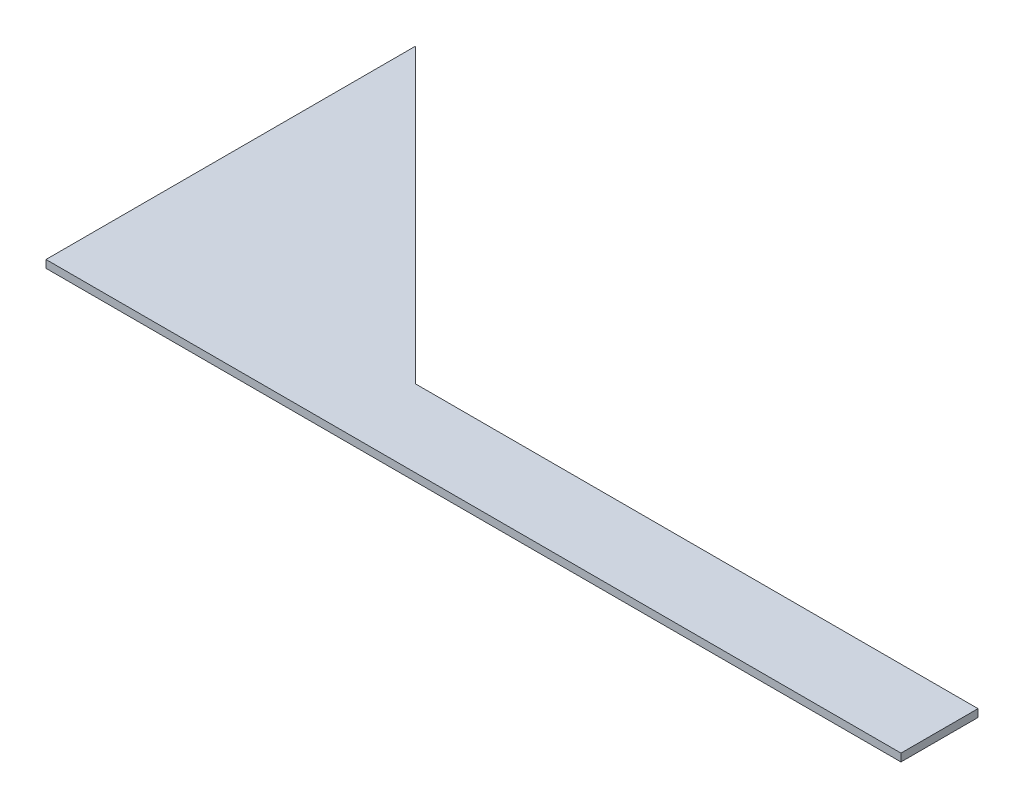
ISO-10303-21;
HEADER;
FILE_DESCRIPTION(('STEP AP214'),'2;1');
FILE_NAME('part.step','',(''),(''),'','','');
FILE_SCHEMA(('AUTOMOTIVE_DESIGN { 1 0 10303 214 1 1 1 1 }'));
ENDSEC;
DATA;
#1=APPLICATION_CONTEXT('core data for automotive mechanical design processes');
#2=APPLICATION_PROTOCOL_DEFINITION('international standard','automotive_design',2000,#1);
#3=PRODUCT_CONTEXT('',#1,'mechanical');
#4=PRODUCT('Part','Part','',(#3));
#5=PRODUCT_RELATED_PRODUCT_CATEGORY('part','',(#4));
#6=PRODUCT_DEFINITION_FORMATION('','',#4);
#7=PRODUCT_DEFINITION_CONTEXT('part definition',#1,'design');
#8=PRODUCT_DEFINITION('design','',#6,#7);
#9=PRODUCT_DEFINITION_SHAPE('','',#8);
#10=(LENGTH_UNIT() NAMED_UNIT(*) SI_UNIT(.MILLI.,.METRE.));
#11=(NAMED_UNIT(*) PLANE_ANGLE_UNIT() SI_UNIT($,.RADIAN.));
#12=(NAMED_UNIT(*) SI_UNIT($,.STERADIAN.) SOLID_ANGLE_UNIT());
#13=UNCERTAINTY_MEASURE_WITH_UNIT(LENGTH_MEASURE(1.E-05),#10,'distance_accuracy_value','');
#14=(GEOMETRIC_REPRESENTATION_CONTEXT(3) GLOBAL_UNCERTAINTY_ASSIGNED_CONTEXT((#13)) GLOBAL_UNIT_ASSIGNED_CONTEXT((#10,
#11,#12)) REPRESENTATION_CONTEXT('',''));
#15=CARTESIAN_POINT('',(0.,0.,0.));
#16=DIRECTION('',(0.,0.,1.));
#17=DIRECTION('',(1.,0.,0.));
#18=AXIS2_PLACEMENT_3D('',#15,#16,#17);
#19=CARTESIAN_POINT('',(-147.976523702142,3.175,0.));
#20=DIRECTION('',(0.,0.,1.));
#21=DIRECTION('',(1.,0.,0.));
#22=AXIS2_PLACEMENT_3D('',#19,#20,#21);
#23=PLANE('',#22);
#24=DIRECTION('',(-1.,0.,0.));
#25=VECTOR('',#24,1.);
#26=CARTESIAN_POINT('',(-147.976523702142,0.,0.));
#27=LINE('',#26,#25);
#28=CARTESIAN_POINT('',(352.425,0.,0.));
#29=VERTEX_POINT('',#28);
#30=CARTESIAN_POINT('',(0.,0.,0.));
#31=VERTEX_POINT('',#30);
#32=EDGE_CURVE('E121',#29,#31,#27,.T.);
#33=ORIENTED_EDGE('',*,*,#32,.F.);
#34=DIRECTION('',(0.,-1.,0.));
#35=VECTOR('',#34,1.);
#36=CARTESIAN_POINT('',(352.425,3.175,0.));
#37=LINE('',#36,#35);
#38=CARTESIAN_POINT('',(352.425,3.175,0.));
#39=VERTEX_POINT('',#38);
#40=EDGE_CURVE('E11',#39,#29,#37,.T.);
#41=ORIENTED_EDGE('',*,*,#40,.F.);
#42=DIRECTION('',(-1.,0.,0.));
#43=VECTOR('',#42,1.);
#44=CARTESIAN_POINT('',(-147.976523702142,3.175,0.));
#45=LINE('',#44,#43);
#46=CARTESIAN_POINT('',(0.,3.175,0.));
#47=VERTEX_POINT('',#46);
#48=EDGE_CURVE('E137',#39,#47,#45,.T.);
#49=ORIENTED_EDGE('',*,*,#48,.T.);
#50=DIRECTION('',(0.,-1.,0.));
#51=VECTOR('',#50,1.);
#52=CARTESIAN_POINT('',(0.,3.175,0.));
#53=LINE('',#52,#51);
#54=EDGE_CURVE('E57',#47,#31,#53,.T.);
#55=ORIENTED_EDGE('',*,*,#54,.T.);
#56=EDGE_LOOP('',(#33,#41,#49,#55));
#57=FACE_BOUND('',#56,.T.);
#58=ADVANCED_FACE('F41',(#57),#23,.T.);
#59=CARTESIAN_POINT('',(352.425,3.175,-51.3261523775401));
#60=DIRECTION('',(1.,0.,0.));
#61=DIRECTION('',(0.,0.,-1.));
#62=AXIS2_PLACEMENT_3D('',#59,#60,#61);
#63=PLANE('',#62);
#64=DIRECTION('',(0.,0.,1.));
#65=VECTOR('',#64,1.);
#66=CARTESIAN_POINT('',(352.425,0.,-51.3261523775401));
#67=LINE('',#66,#65);
#68=CARTESIAN_POINT('',(352.425,0.,-31.75));
#69=VERTEX_POINT('',#68);
#70=EDGE_CURVE('E124',#69,#29,#67,.T.);
#71=ORIENTED_EDGE('',*,*,#70,.F.);
#72=DIRECTION('',(0.,-1.,0.));
#73=VECTOR('',#72,1.);
#74=CARTESIAN_POINT('',(352.425,3.175,-31.75));
#75=LINE('',#74,#73);
#76=CARTESIAN_POINT('',(352.425,3.175,-31.75));
#77=VERTEX_POINT('',#76);
#78=EDGE_CURVE('E49',#77,#69,#75,.T.);
#79=ORIENTED_EDGE('',*,*,#78,.F.);
#80=DIRECTION('',(0.,0.,1.));
#81=VECTOR('',#80,1.);
#82=CARTESIAN_POINT('',(352.425,3.175,-51.3261523775401));
#83=LINE('',#82,#81);
#84=EDGE_CURVE('E110',#77,#39,#83,.T.);
#85=ORIENTED_EDGE('',*,*,#84,.T.);
#86=ORIENTED_EDGE('',*,*,#40,.T.);
#87=EDGE_LOOP('',(#71,#79,#85,#86));
#88=FACE_BOUND('',#87,.T.);
#89=ADVANCED_FACE('F143',(#88),#63,.T.);
#90=CARTESIAN_POINT('',(-147.976523702142,3.175,-31.75));
#91=DIRECTION('',(0.,0.,-1.));
#92=DIRECTION('',(-1.,0.,0.));
#93=AXIS2_PLACEMENT_3D('',#90,#91,#92);
#94=PLANE('',#93);
#95=DIRECTION('',(1.,0.,0.));
#96=VECTOR('',#95,1.);
#97=CARTESIAN_POINT('',(-147.976523702142,0.,-31.75));
#98=LINE('',#97,#96);
#99=CARTESIAN_POINT('',(120.65,0.,-31.7499999999999));
#100=VERTEX_POINT('',#99);
#101=EDGE_CURVE('E97',#100,#69,#98,.T.);
#102=ORIENTED_EDGE('',*,*,#101,.F.);
#103=DIRECTION('',(0.,-1.,0.));
#104=VECTOR('',#103,1.);
#105=CARTESIAN_POINT('',(120.65,3.175,-31.7499999999999));
#106=LINE('',#105,#104);
#107=CARTESIAN_POINT('',(120.65,3.175,-31.7499999999999));
#108=VERTEX_POINT('',#107);
#109=EDGE_CURVE('E92',#108,#100,#106,.T.);
#110=ORIENTED_EDGE('',*,*,#109,.F.);
#111=DIRECTION('',(1.,0.,0.));
#112=VECTOR('',#111,1.);
#113=CARTESIAN_POINT('',(-147.976523702142,3.175,-31.75));
#114=LINE('',#113,#112);
#115=EDGE_CURVE('E95',#108,#77,#114,.T.);
#116=ORIENTED_EDGE('',*,*,#115,.T.);
#117=ORIENTED_EDGE('',*,*,#78,.T.);
#118=EDGE_LOOP('',(#102,#110,#116,#117));
#119=FACE_BOUND('',#118,.T.);
#120=ADVANCED_FACE('F94',(#119),#94,.T.);
#121=CARTESIAN_POINT('',(-23.4513380398412,3.175,-175.851338039841));
#122=DIRECTION('',(0.707106781186548,0.,-0.707106781186548));
#123=DIRECTION('',(-0.707106781186548,0.,-0.707106781186548));
#124=AXIS2_PLACEMENT_3D('',#121,#122,#123);
#125=PLANE('',#124);
#126=DIRECTION('',(0.707106781186548,0.,0.707106781186548));
#127=VECTOR('',#126,1.);
#128=CARTESIAN_POINT('',(-23.4513380398412,0.,-175.851338039841));
#129=LINE('',#128,#127);
#130=CARTESIAN_POINT('',(0.,0.,-152.4));
#131=VERTEX_POINT('',#130);
#132=EDGE_CURVE('E130',#131,#100,#129,.T.);
#133=ORIENTED_EDGE('',*,*,#132,.F.);
#134=DIRECTION('',(0.,-1.,0.));
#135=VECTOR('',#134,1.);
#136=CARTESIAN_POINT('',(0.,3.175,-152.4));
#137=LINE('',#136,#135);
#138=CARTESIAN_POINT('',(0.,3.175,-152.4));
#139=VERTEX_POINT('',#138);
#140=EDGE_CURVE('E75',#139,#131,#137,.T.);
#141=ORIENTED_EDGE('',*,*,#140,.F.);
#142=DIRECTION('',(0.707106781186548,0.,0.707106781186548));
#143=VECTOR('',#142,1.);
#144=CARTESIAN_POINT('',(-23.4513380398412,3.175,-175.851338039841));
#145=LINE('',#144,#143);
#146=EDGE_CURVE('E108',#139,#108,#145,.T.);
#147=ORIENTED_EDGE('',*,*,#146,.T.);
#148=ORIENTED_EDGE('',*,*,#109,.T.);
#149=EDGE_LOOP('',(#133,#141,#147,#148));
#150=FACE_BOUND('',#149,.T.);
#151=ADVANCED_FACE('F113',(#150),#125,.T.);
#152=CARTESIAN_POINT('',(0.,3.175,-51.3261523775401));
#153=DIRECTION('',(-1.,0.,0.));
#154=DIRECTION('',(0.,0.,1.));
#155=AXIS2_PLACEMENT_3D('',#152,#153,#154);
#156=PLANE('',#155);
#157=DIRECTION('',(0.,0.,-1.));
#158=VECTOR('',#157,1.);
#159=CARTESIAN_POINT('',(0.,0.,-51.3261523775401));
#160=LINE('',#159,#158);
#161=EDGE_CURVE('E133',#31,#131,#160,.T.);
#162=ORIENTED_EDGE('',*,*,#161,.F.);
#163=ORIENTED_EDGE('',*,*,#54,.F.);
#164=DIRECTION('',(0.,0.,-1.));
#165=VECTOR('',#164,1.);
#166=CARTESIAN_POINT('',(0.,3.175,-51.3261523775401));
#167=LINE('',#166,#165);
#168=EDGE_CURVE('E115',#47,#139,#167,.T.);
#169=ORIENTED_EDGE('',*,*,#168,.T.);
#170=ORIENTED_EDGE('',*,*,#140,.T.);
#171=EDGE_LOOP('',(#162,#163,#169,#170));
#172=FACE_BOUND('',#171,.T.);
#173=ADVANCED_FACE('F146',(#172),#156,.T.);
#174=CARTESIAN_POINT('',(-147.976523702142,3.175,-51.3261523775401));
#175=DIRECTION('',(0.,1.,0.));
#176=DIRECTION('',(0.,0.,1.));
#177=AXIS2_PLACEMENT_3D('',#174,#175,#176);
#178=PLANE('',#177);
#179=ORIENTED_EDGE('',*,*,#48,.F.);
#180=ORIENTED_EDGE('',*,*,#84,.F.);
#181=ORIENTED_EDGE('',*,*,#115,.F.);
#182=ORIENTED_EDGE('',*,*,#146,.F.);
#183=ORIENTED_EDGE('',*,*,#168,.F.);
#184=EDGE_LOOP('',(#179,#180,#181,#182,#183));
#185=FACE_BOUND('',#184,.T.);
#186=ADVANCED_FACE('F106',(#185),#178,.T.);
#187=CARTESIAN_POINT('',(-147.976523702142,0.,-51.3261523775401));
#188=DIRECTION('',(0.,1.,0.));
#189=DIRECTION('',(0.,0.,1.));
#190=AXIS2_PLACEMENT_3D('',#187,#188,#189);
#191=PLANE('',#190);
#192=ORIENTED_EDGE('',*,*,#32,.T.);
#193=ORIENTED_EDGE('',*,*,#161,.T.);
#194=ORIENTED_EDGE('',*,*,#132,.T.);
#195=ORIENTED_EDGE('',*,*,#101,.T.);
#196=ORIENTED_EDGE('',*,*,#70,.T.);
#197=EDGE_LOOP('',(#192,#193,#194,#195,#196));
#198=FACE_BOUND('',#197,.T.);
#199=ADVANCED_FACE('F145',(#198),#191,.F.);
#200=CLOSED_SHELL('',(#58,#89,#120,#151,#173,#186,#199));
#201=MANIFOLD_SOLID_BREP('B2',#200);
#202=ADVANCED_BREP_SHAPE_REPRESENTATION('',(#18,#201),#14);
#203=SHAPE_DEFINITION_REPRESENTATION(#9,#202);
ENDSEC;
END-ISO-10303-21;
